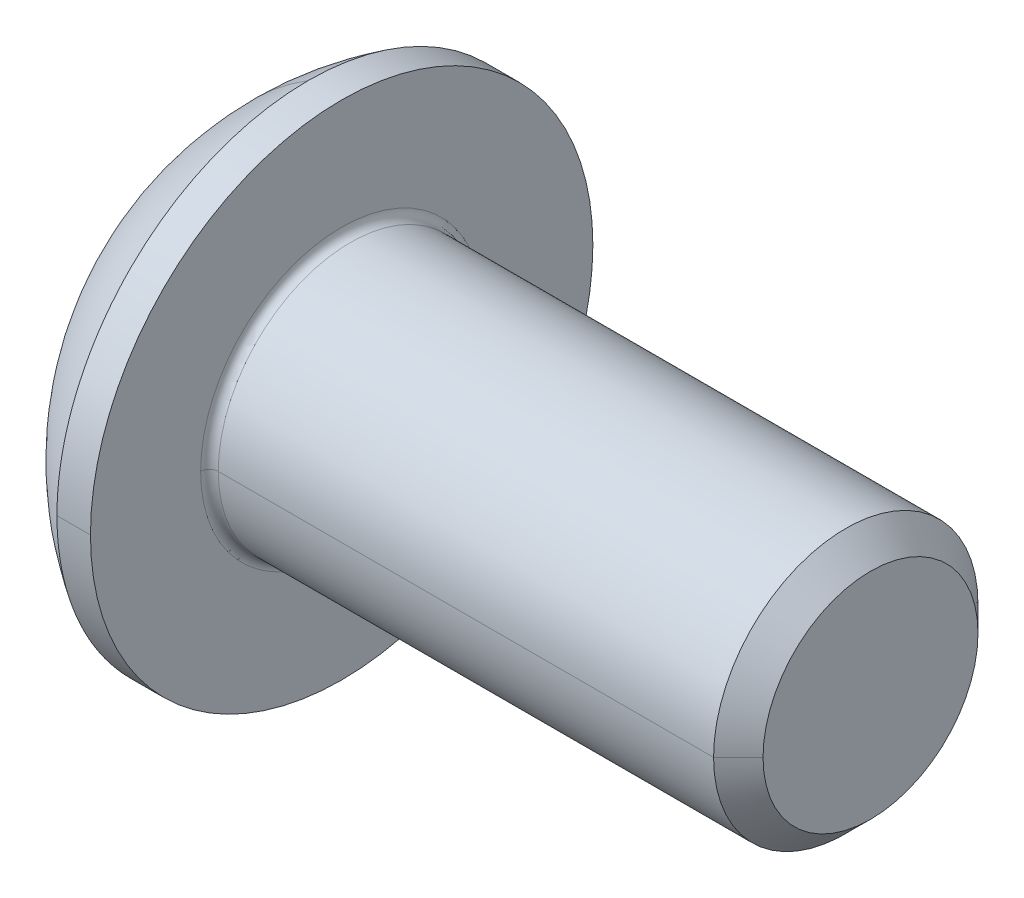
ISO-10303-21;
HEADER;
FILE_DESCRIPTION(('STEP AP214'),'2;1');
FILE_NAME('part.step','',(''),(''),'','','');
FILE_SCHEMA(('AUTOMOTIVE_DESIGN { 1 0 10303 214 1 1 1 1 }'));
ENDSEC;
DATA;
#1=APPLICATION_CONTEXT('core data for automotive mechanical design processes');
#2=APPLICATION_PROTOCOL_DEFINITION('international standard','automotive_design',2000,#1);
#3=PRODUCT_CONTEXT('',#1,'mechanical');
#4=PRODUCT('Part','Part','',(#3));
#5=PRODUCT_RELATED_PRODUCT_CATEGORY('part','',(#4));
#6=PRODUCT_DEFINITION_FORMATION('','',#4);
#7=PRODUCT_DEFINITION_CONTEXT('part definition',#1,'design');
#8=PRODUCT_DEFINITION('design','',#6,#7);
#9=PRODUCT_DEFINITION_SHAPE('','',#8);
#10=(LENGTH_UNIT() NAMED_UNIT(*) SI_UNIT(.MILLI.,.METRE.));
#11=(NAMED_UNIT(*) PLANE_ANGLE_UNIT() SI_UNIT($,.RADIAN.));
#12=(NAMED_UNIT(*) SI_UNIT($,.STERADIAN.) SOLID_ANGLE_UNIT());
#13=UNCERTAINTY_MEASURE_WITH_UNIT(LENGTH_MEASURE(1.E-05),#10,'distance_accuracy_value','');
#14=(GEOMETRIC_REPRESENTATION_CONTEXT(3) GLOBAL_UNCERTAINTY_ASSIGNED_CONTEXT((#13)) GLOBAL_UNIT_ASSIGNED_CONTEXT((#10,
#11,#12)) REPRESENTATION_CONTEXT('',''));
#15=CARTESIAN_POINT('',(0.,0.,0.));
#16=DIRECTION('',(0.,0.,1.));
#17=DIRECTION('',(1.,0.,0.));
#18=AXIS2_PLACEMENT_3D('',#15,#16,#17);
#19=CARTESIAN_POINT('',(-998.38264973081,0.,0.));
#20=DIRECTION('',(-1.,0.,0.));
#21=DIRECTION('',(0.,0.,1.));
#22=AXIS2_PLACEMENT_3D('',#19,#20,#21);
#23=CONICAL_SURFACE('',#22,1732.05080756885,1.0471975511966);
#24=DIRECTION('',(-0.5,0.,-0.866025403784436));
#25=VECTOR('',#24,1.);
#26=CARTESIAN_POINT('',(1.61735026918964,0.,0.));
#27=LINE('',#26,#25);
#28=CARTESIAN_POINT('',(1.61735026918964,0.,0.));
#29=VERTEX_POINT('',#28);
#30=CARTESIAN_POINT('',(1.04,0.,-1.));
#31=VERTEX_POINT('',#30);
#32=EDGE_CURVE('E214',#29,#31,#27,.T.);
#33=ORIENTED_EDGE('',*,*,#32,.F.);
#34=DIRECTION('',(-0.5,0.,0.866025403784436));
#35=VECTOR('',#34,1.);
#36=CARTESIAN_POINT('',(1.61735026918964,0.,0.));
#37=LINE('',#36,#35);
#38=CARTESIAN_POINT('',(1.04,0.,1.));
#39=VERTEX_POINT('',#38);
#40=EDGE_CURVE('E207',#29,#39,#37,.T.);
#41=ORIENTED_EDGE('',*,*,#40,.T.);
#42=CARTESIAN_POINT('',(1.04,0.,0.));
#43=DIRECTION('',(-1.,0.,0.));
#44=DIRECTION('',(0.,0.,1.));
#45=AXIS2_PLACEMENT_3D('',#42,#43,#44);
#46=CIRCLE('',#45,1.);
#47=CARTESIAN_POINT('',(1.04,0.86602540378444,0.5));
#48=VERTEX_POINT('',#47);
#49=EDGE_CURVE('E11',#39,#48,#46,.T.);
#50=ORIENTED_EDGE('',*,*,#49,.T.);
#51=CARTESIAN_POINT('',(1.04,0.,0.));
#52=DIRECTION('',(-1.,0.,0.));
#53=DIRECTION('',(0.,0.,1.));
#54=AXIS2_PLACEMENT_3D('',#51,#52,#53);
#55=CIRCLE('',#54,1.);
#56=CARTESIAN_POINT('',(1.04,0.86602540378444,-0.5));
#57=VERTEX_POINT('',#56);
#58=EDGE_CURVE('E24',#48,#57,#55,.T.);
#59=ORIENTED_EDGE('',*,*,#58,.T.);
#60=CARTESIAN_POINT('',(1.04,0.,0.));
#61=DIRECTION('',(-1.,0.,0.));
#62=DIRECTION('',(0.,0.,1.));
#63=AXIS2_PLACEMENT_3D('',#60,#61,#62);
#64=CIRCLE('',#63,1.);
#65=EDGE_CURVE('E196',#57,#31,#64,.T.);
#66=ORIENTED_EDGE('',*,*,#65,.T.);
#67=EDGE_LOOP('',(#33,#41,#50,#59,#66));
#68=FACE_BOUND('',#67,.T.);
#69=ADVANCED_FACE('F16',(#68),#23,.F.);
#70=CARTESIAN_POINT('',(1.04,-1.73205080756887,-1.));
#71=DIRECTION('',(1.,0.,0.));
#72=DIRECTION('',(0.,1.,0.));
#73=AXIS2_PLACEMENT_3D('',#70,#71,#72);
#74=PLANE('',#73);
#75=CARTESIAN_POINT('',(1.04,0.,0.));
#76=DIRECTION('',(-1.,0.,0.));
#77=DIRECTION('',(0.,0.,1.));
#78=AXIS2_PLACEMENT_3D('',#75,#76,#77);
#79=CIRCLE('',#78,1.);
#80=CARTESIAN_POINT('',(1.04,-0.86602540378444,-0.5));
#81=VERTEX_POINT('',#80);
#82=EDGE_CURVE('E221',#31,#81,#79,.T.);
#83=ORIENTED_EDGE('',*,*,#82,.F.);
#84=DIRECTION('',(0.,1.,0.));
#85=VECTOR('',#84,1.);
#86=CARTESIAN_POINT('',(1.04,0.577350269189628,-1.));
#87=LINE('',#86,#85);
#88=CARTESIAN_POINT('',(1.04,-0.577350269189626,-1.));
#89=VERTEX_POINT('',#88);
#90=EDGE_CURVE('E290',#89,#31,#87,.T.);
#91=ORIENTED_EDGE('',*,*,#90,.F.);
#92=DIRECTION('',(0.,0.5,-0.86602540378444));
#93=VECTOR('',#92,1.);
#94=CARTESIAN_POINT('',(1.04,-0.577350269189626,-1.));
#95=LINE('',#94,#93);
#96=EDGE_CURVE('E232',#81,#89,#95,.T.);
#97=ORIENTED_EDGE('',*,*,#96,.F.);
#98=EDGE_LOOP('',(#83,#91,#97));
#99=FACE_BOUND('',#98,.T.);
#100=ADVANCED_FACE('F420',(#99),#74,.F.);
#101=CARTESIAN_POINT('',(1.04,-1.73205080756887,-1.));
#102=DIRECTION('',(1.,0.,0.));
#103=DIRECTION('',(0.,1.,0.));
#104=AXIS2_PLACEMENT_3D('',#101,#102,#103);
#105=PLANE('',#104);
#106=CARTESIAN_POINT('',(1.04,0.,0.));
#107=DIRECTION('',(-1.,0.,0.));
#108=DIRECTION('',(0.,0.,1.));
#109=AXIS2_PLACEMENT_3D('',#106,#107,#108);
#110=CIRCLE('',#109,1.);
#111=CARTESIAN_POINT('',(1.04,-0.866025403784437,0.5));
#112=VERTEX_POINT('',#111);
#113=EDGE_CURVE('E210',#81,#112,#110,.T.);
#114=ORIENTED_EDGE('',*,*,#113,.F.);
#115=DIRECTION('',(0.,0.5,-0.86602540378444));
#116=VECTOR('',#115,1.);
#117=CARTESIAN_POINT('',(1.04,-0.577350269189626,-1.));
#118=LINE('',#117,#116);
#119=CARTESIAN_POINT('',(1.04,-1.15470053837925,0.));
#120=VERTEX_POINT('',#119);
#121=EDGE_CURVE('E236',#120,#81,#118,.T.);
#122=ORIENTED_EDGE('',*,*,#121,.F.);
#123=DIRECTION('',(0.,-0.5,-0.866025403784439));
#124=VECTOR('',#123,1.);
#125=CARTESIAN_POINT('',(1.04,-1.15470053837925,0.));
#126=LINE('',#125,#124);
#127=EDGE_CURVE('E359',#112,#120,#126,.T.);
#128=ORIENTED_EDGE('',*,*,#127,.F.);
#129=EDGE_LOOP('',(#114,#122,#128));
#130=FACE_BOUND('',#129,.T.);
#131=ADVANCED_FACE('F426',(#130),#105,.F.);
#132=CARTESIAN_POINT('',(1.04,-1.73205080756887,-1.));
#133=DIRECTION('',(1.,0.,0.));
#134=DIRECTION('',(0.,1.,0.));
#135=AXIS2_PLACEMENT_3D('',#132,#133,#134);
#136=PLANE('',#135);
#137=CARTESIAN_POINT('',(1.04,0.,0.));
#138=DIRECTION('',(-1.,0.,0.));
#139=DIRECTION('',(0.,0.,1.));
#140=AXIS2_PLACEMENT_3D('',#137,#138,#139);
#141=CIRCLE('',#140,1.);
#142=EDGE_CURVE('E189',#112,#39,#141,.T.);
#143=ORIENTED_EDGE('',*,*,#142,.F.);
#144=DIRECTION('',(0.,-0.5,-0.866025403784439));
#145=VECTOR('',#144,1.);
#146=CARTESIAN_POINT('',(1.04,-1.15470053837925,0.));
#147=LINE('',#146,#145);
#148=CARTESIAN_POINT('',(1.04,-0.577350269189625,1.));
#149=VERTEX_POINT('',#148);
#150=EDGE_CURVE('E192',#149,#112,#147,.T.);
#151=ORIENTED_EDGE('',*,*,#150,.F.);
#152=DIRECTION('',(0.,-1.,0.));
#153=VECTOR('',#152,1.);
#154=CARTESIAN_POINT('',(1.04,-0.577350269189625,1.));
#155=LINE('',#154,#153);
#156=EDGE_CURVE('E186',#39,#149,#155,.T.);
#157=ORIENTED_EDGE('',*,*,#156,.F.);
#158=EDGE_LOOP('',(#143,#151,#157));
#159=FACE_BOUND('',#158,.T.);
#160=ADVANCED_FACE('F187',(#159),#136,.F.);
#161=CARTESIAN_POINT('',(1.04,-1.73205080756887,-1.));
#162=DIRECTION('',(1.,0.,0.));
#163=DIRECTION('',(0.,1.,0.));
#164=AXIS2_PLACEMENT_3D('',#161,#162,#163);
#165=PLANE('',#164);
#166=ORIENTED_EDGE('',*,*,#49,.F.);
#167=DIRECTION('',(0.,-1.,0.));
#168=VECTOR('',#167,1.);
#169=CARTESIAN_POINT('',(1.04,-0.577350269189625,1.));
#170=LINE('',#169,#168);
#171=CARTESIAN_POINT('',(1.04,0.577350269189628,1.));
#172=VERTEX_POINT('',#171);
#173=EDGE_CURVE('E37',#172,#39,#170,.T.);
#174=ORIENTED_EDGE('',*,*,#173,.F.);
#175=DIRECTION('',(0.,-0.5,0.86602540378444));
#176=VECTOR('',#175,1.);
#177=CARTESIAN_POINT('',(1.04,0.577350269189628,1.));
#178=LINE('',#177,#176);
#179=EDGE_CURVE('E181',#48,#172,#178,.T.);
#180=ORIENTED_EDGE('',*,*,#179,.F.);
#181=EDGE_LOOP('',(#166,#174,#180));
#182=FACE_BOUND('',#181,.T.);
#183=ADVANCED_FACE('F179',(#182),#165,.F.);
#184=CARTESIAN_POINT('',(1.04,-1.73205080756887,-1.));
#185=DIRECTION('',(1.,0.,0.));
#186=DIRECTION('',(0.,1.,0.));
#187=AXIS2_PLACEMENT_3D('',#184,#185,#186);
#188=PLANE('',#187);
#189=ORIENTED_EDGE('',*,*,#58,.F.);
#190=DIRECTION('',(0.,-0.5,0.86602540378444));
#191=VECTOR('',#190,1.);
#192=CARTESIAN_POINT('',(1.04,0.577350269189628,1.));
#193=LINE('',#192,#191);
#194=CARTESIAN_POINT('',(1.04,1.15470053837925,0.));
#195=VERTEX_POINT('',#194);
#196=EDGE_CURVE('E372',#195,#48,#193,.T.);
#197=ORIENTED_EDGE('',*,*,#196,.F.);
#198=DIRECTION('',(0.,0.5,0.86602540378444));
#199=VECTOR('',#198,1.);
#200=CARTESIAN_POINT('',(1.04,1.15470053837925,0.));
#201=LINE('',#200,#199);
#202=EDGE_CURVE('E384',#57,#195,#201,.T.);
#203=ORIENTED_EDGE('',*,*,#202,.F.);
#204=EDGE_LOOP('',(#189,#197,#203));
#205=FACE_BOUND('',#204,.T.);
#206=ADVANCED_FACE('F409',(#205),#188,.F.);
#207=CARTESIAN_POINT('',(1.04,-1.73205080756887,-1.));
#208=DIRECTION('',(1.,0.,0.));
#209=DIRECTION('',(0.,1.,0.));
#210=AXIS2_PLACEMENT_3D('',#207,#208,#209);
#211=PLANE('',#210);
#212=ORIENTED_EDGE('',*,*,#65,.F.);
#213=DIRECTION('',(0.,0.5,0.86602540378444));
#214=VECTOR('',#213,1.);
#215=CARTESIAN_POINT('',(1.04,1.15470053837925,0.));
#216=LINE('',#215,#214);
#217=CARTESIAN_POINT('',(1.04,0.577350269189628,-1.));
#218=VERTEX_POINT('',#217);
#219=EDGE_CURVE('E380',#218,#57,#216,.T.);
#220=ORIENTED_EDGE('',*,*,#219,.F.);
#221=DIRECTION('',(0.,1.,0.));
#222=VECTOR('',#221,1.);
#223=CARTESIAN_POINT('',(1.04,0.577350269189628,-1.));
#224=LINE('',#223,#222);
#225=EDGE_CURVE('E379',#31,#218,#224,.T.);
#226=ORIENTED_EDGE('',*,*,#225,.F.);
#227=EDGE_LOOP('',(#212,#220,#226));
#228=FACE_BOUND('',#227,.T.);
#229=ADVANCED_FACE('F407',(#228),#211,.F.);
#230=CARTESIAN_POINT('',(1.04,-0.577350269189625,1.));
#231=DIRECTION('',(0.,0.,-1.));
#232=DIRECTION('',(-1.,0.,0.));
#233=AXIS2_PLACEMENT_3D('',#230,#231,#232);
#234=PLANE('',#233);
#235=ORIENTED_EDGE('',*,*,#173,.T.);
#236=ORIENTED_EDGE('',*,*,#156,.T.);
#237=DIRECTION('',(-1.,0.,0.));
#238=VECTOR('',#237,1.);
#239=CARTESIAN_POINT('',(1.04,-0.577350269189625,1.));
#240=LINE('',#239,#238);
#241=CARTESIAN_POINT('',(0.,-0.577350269189625,1.));
#242=VERTEX_POINT('',#241);
#243=EDGE_CURVE('E366',#149,#242,#240,.T.);
#244=ORIENTED_EDGE('',*,*,#243,.T.);
#245=DIRECTION('',(0.,-1.,0.));
#246=VECTOR('',#245,1.);
#247=CARTESIAN_POINT('',(0.,-0.577350269189625,1.));
#248=LINE('',#247,#246);
#249=CARTESIAN_POINT('',(0.,0.577350269189628,1.));
#250=VERTEX_POINT('',#249);
#251=EDGE_CURVE('E301',#250,#242,#248,.T.);
#252=ORIENTED_EDGE('',*,*,#251,.F.);
#253=DIRECTION('',(-1.,0.,0.));
#254=VECTOR('',#253,1.);
#255=CARTESIAN_POINT('',(1.04,0.577350269189628,1.));
#256=LINE('',#255,#254);
#257=EDGE_CURVE('E200',#172,#250,#256,.T.);
#258=ORIENTED_EDGE('',*,*,#257,.F.);
#259=EDGE_LOOP('',(#235,#236,#244,#252,#258));
#260=FACE_BOUND('',#259,.T.);
#261=ADVANCED_FACE('F198',(#260),#234,.T.);
#262=CARTESIAN_POINT('',(1.04,0.577350269189628,1.));
#263=DIRECTION('',(0.,-0.86602540378444,-0.5));
#264=DIRECTION('',(0.,0.5,-0.86602540378444));
#265=AXIS2_PLACEMENT_3D('',#262,#263,#264);
#266=PLANE('',#265);
#267=ORIENTED_EDGE('',*,*,#196,.T.);
#268=ORIENTED_EDGE('',*,*,#179,.T.);
#269=ORIENTED_EDGE('',*,*,#257,.T.);
#270=DIRECTION('',(0.,-0.5,0.86602540378444));
#271=VECTOR('',#270,1.);
#272=CARTESIAN_POINT('',(0.,0.577350269189628,1.));
#273=LINE('',#272,#271);
#274=CARTESIAN_POINT('',(0.,1.15470053837925,0.));
#275=VERTEX_POINT('',#274);
#276=EDGE_CURVE('E293',#275,#250,#273,.T.);
#277=ORIENTED_EDGE('',*,*,#276,.F.);
#278=DIRECTION('',(-1.,0.,0.));
#279=VECTOR('',#278,1.);
#280=CARTESIAN_POINT('',(1.04,1.15470053837925,0.));
#281=LINE('',#280,#279);
#282=EDGE_CURVE('E375',#195,#275,#281,.T.);
#283=ORIENTED_EDGE('',*,*,#282,.F.);
#284=EDGE_LOOP('',(#267,#268,#269,#277,#283));
#285=FACE_BOUND('',#284,.T.);
#286=ADVANCED_FACE('F435',(#285),#266,.T.);
#287=CARTESIAN_POINT('',(1.04,1.15470053837925,0.));
#288=DIRECTION('',(0.,-0.86602540378444,0.5));
#289=DIRECTION('',(-1.,0.,0.));
#290=AXIS2_PLACEMENT_3D('',#287,#288,#289);
#291=PLANE('',#290);
#292=ORIENTED_EDGE('',*,*,#219,.T.);
#293=ORIENTED_EDGE('',*,*,#202,.T.);
#294=ORIENTED_EDGE('',*,*,#282,.T.);
#295=DIRECTION('',(0.,0.5,0.86602540378444));
#296=VECTOR('',#295,1.);
#297=CARTESIAN_POINT('',(0.,1.15470053837925,0.));
#298=LINE('',#297,#296);
#299=CARTESIAN_POINT('',(0.,0.577350269189628,-1.));
#300=VERTEX_POINT('',#299);
#301=EDGE_CURVE('E348',#300,#275,#298,.T.);
#302=ORIENTED_EDGE('',*,*,#301,.F.);
#303=DIRECTION('',(-1.,0.,0.));
#304=VECTOR('',#303,1.);
#305=CARTESIAN_POINT('',(1.04,0.577350269189628,-1.));
#306=LINE('',#305,#304);
#307=EDGE_CURVE('E385',#218,#300,#306,.T.);
#308=ORIENTED_EDGE('',*,*,#307,.F.);
#309=EDGE_LOOP('',(#292,#293,#294,#302,#308));
#310=FACE_BOUND('',#309,.T.);
#311=ADVANCED_FACE('F412',(#310),#291,.T.);
#312=CARTESIAN_POINT('',(1.04,0.577350269189628,-1.));
#313=DIRECTION('',(0.,0.,1.));
#314=DIRECTION('',(1.,0.,0.));
#315=AXIS2_PLACEMENT_3D('',#312,#313,#314);
#316=PLANE('',#315);
#317=ORIENTED_EDGE('',*,*,#90,.T.);
#318=ORIENTED_EDGE('',*,*,#225,.T.);
#319=ORIENTED_EDGE('',*,*,#307,.T.);
#320=DIRECTION('',(0.,1.,0.));
#321=VECTOR('',#320,1.);
#322=CARTESIAN_POINT('',(0.,0.577350269189628,-1.));
#323=LINE('',#322,#321);
#324=CARTESIAN_POINT('',(0.,-0.577350269189626,-1.));
#325=VERTEX_POINT('',#324);
#326=EDGE_CURVE('E344',#325,#300,#323,.T.);
#327=ORIENTED_EDGE('',*,*,#326,.F.);
#328=DIRECTION('',(-1.,0.,0.));
#329=VECTOR('',#328,1.);
#330=CARTESIAN_POINT('',(1.04,-0.577350269189626,-1.));
#331=LINE('',#330,#329);
#332=EDGE_CURVE('E235',#89,#325,#331,.T.);
#333=ORIENTED_EDGE('',*,*,#332,.F.);
#334=EDGE_LOOP('',(#317,#318,#319,#327,#333));
#335=FACE_BOUND('',#334,.T.);
#336=ADVANCED_FACE('F416',(#335),#316,.T.);
#337=CARTESIAN_POINT('',(1.04,-0.577350269189626,-1.));
#338=DIRECTION('',(0.,0.86602540378444,0.5));
#339=DIRECTION('',(1.,0.,0.));
#340=AXIS2_PLACEMENT_3D('',#337,#338,#339);
#341=PLANE('',#340);
#342=ORIENTED_EDGE('',*,*,#121,.T.);
#343=ORIENTED_EDGE('',*,*,#96,.T.);
#344=ORIENTED_EDGE('',*,*,#332,.T.);
#345=DIRECTION('',(0.,0.5,-0.86602540378444));
#346=VECTOR('',#345,1.);
#347=CARTESIAN_POINT('',(0.,-0.577350269189626,-1.));
#348=LINE('',#347,#346);
#349=CARTESIAN_POINT('',(0.,-1.15470053837925,0.));
#350=VERTEX_POINT('',#349);
#351=EDGE_CURVE('E340',#350,#325,#348,.T.);
#352=ORIENTED_EDGE('',*,*,#351,.F.);
#353=DIRECTION('',(-1.,0.,0.));
#354=VECTOR('',#353,1.);
#355=CARTESIAN_POINT('',(1.04,-1.15470053837925,0.));
#356=LINE('',#355,#354);
#357=EDGE_CURVE('E363',#120,#350,#356,.T.);
#358=ORIENTED_EDGE('',*,*,#357,.F.);
#359=EDGE_LOOP('',(#342,#343,#344,#352,#358));
#360=FACE_BOUND('',#359,.T.);
#361=ADVANCED_FACE('F423',(#360),#341,.T.);
#362=CARTESIAN_POINT('',(1.04,-1.15470053837925,0.));
#363=DIRECTION('',(0.,0.866025403784439,-0.5));
#364=DIRECTION('',(-1.,0.,0.));
#365=AXIS2_PLACEMENT_3D('',#362,#363,#364);
#366=PLANE('',#365);
#367=ORIENTED_EDGE('',*,*,#150,.T.);
#368=ORIENTED_EDGE('',*,*,#127,.T.);
#369=ORIENTED_EDGE('',*,*,#357,.T.);
#370=DIRECTION('',(0.,-0.5,-0.866025403784439));
#371=VECTOR('',#370,1.);
#372=CARTESIAN_POINT('',(0.,-1.15470053837925,0.));
#373=LINE('',#372,#371);
#374=EDGE_CURVE('E336',#242,#350,#373,.T.);
#375=ORIENTED_EDGE('',*,*,#374,.F.);
#376=ORIENTED_EDGE('',*,*,#243,.F.);
#377=EDGE_LOOP('',(#367,#368,#369,#375,#376));
#378=FACE_BOUND('',#377,.T.);
#379=ADVANCED_FACE('F428',(#378),#366,.T.);
#380=CARTESIAN_POINT('',(1.75,0.,0.));
#381=DIRECTION('',(-1.,0.,0.));
#382=DIRECTION('',(0.,0.,1.));
#383=AXIS2_PLACEMENT_3D('',#380,#381,#382);
#384=TOROIDAL_SURFACE('',#383,1.6,0.1);
#385=CARTESIAN_POINT('',(1.75,0.,-1.6));
#386=DIRECTION('',(0.,1.,0.));
#387=DIRECTION('',(0.,0.,1.));
#388=AXIS2_PLACEMENT_3D('',#385,#386,#387);
#389=CIRCLE('',#388,0.1);
#390=CARTESIAN_POINT('',(1.65,0.,-1.6));
#391=VERTEX_POINT('',#390);
#392=CARTESIAN_POINT('',(1.75,0.,-1.5));
#393=VERTEX_POINT('',#392);
#394=EDGE_CURVE('E231',#391,#393,#389,.T.);
#395=ORIENTED_EDGE('',*,*,#394,.F.);
#396=CARTESIAN_POINT('',(1.65,0.,0.));
#397=DIRECTION('',(-1.,0.,0.));
#398=DIRECTION('',(0.,0.,1.));
#399=AXIS2_PLACEMENT_3D('',#396,#397,#398);
#400=CIRCLE('',#399,1.6);
#401=CARTESIAN_POINT('',(1.65,0.,1.6));
#402=VERTEX_POINT('',#401);
#403=EDGE_CURVE('E244',#402,#391,#400,.T.);
#404=ORIENTED_EDGE('',*,*,#403,.F.);
#405=CARTESIAN_POINT('',(1.75,0.,1.6));
#406=DIRECTION('',(0.,-1.,0.));
#407=DIRECTION('',(0.,0.,-1.));
#408=AXIS2_PLACEMENT_3D('',#405,#406,#407);
#409=CIRCLE('',#408,0.1);
#410=CARTESIAN_POINT('',(1.75,0.,1.5));
#411=VERTEX_POINT('',#410);
#412=EDGE_CURVE('E230',#402,#411,#409,.T.);
#413=ORIENTED_EDGE('',*,*,#412,.T.);
#414=CARTESIAN_POINT('',(1.75,0.,0.));
#415=DIRECTION('',(1.,0.,0.));
#416=DIRECTION('',(0.,0.,1.));
#417=AXIS2_PLACEMENT_3D('',#414,#415,#416);
#418=CIRCLE('',#417,1.5);
#419=EDGE_CURVE('E259',#393,#411,#418,.T.);
#420=ORIENTED_EDGE('',*,*,#419,.F.);
#421=EDGE_LOOP('',(#395,#404,#413,#420));
#422=FACE_BOUND('',#421,.T.);
#423=ADVANCED_FACE('F518',(#422),#384,.F.);
#424=CARTESIAN_POINT('',(7.65,0.,0.));
#425=DIRECTION('',(-1.,0.,0.));
#426=DIRECTION('',(0.,0.,1.));
#427=AXIS2_PLACEMENT_3D('',#424,#425,#426);
#428=PLANE('',#427);
#429=CARTESIAN_POINT('',(7.65,0.,0.));
#430=DIRECTION('',(-1.,0.,0.));
#431=DIRECTION('',(0.,0.,1.));
#432=AXIS2_PLACEMENT_3D('',#429,#430,#431);
#433=CIRCLE('',#432,1.2195);
#434=CARTESIAN_POINT('',(7.65,0.,1.2195));
#435=VERTEX_POINT('',#434);
#436=CARTESIAN_POINT('',(7.65,0.,-1.2195));
#437=VERTEX_POINT('',#436);
#438=EDGE_CURVE('E242',#435,#437,#433,.T.);
#439=ORIENTED_EDGE('',*,*,#438,.F.);
#440=CARTESIAN_POINT('',(7.65,0.,0.));
#441=DIRECTION('',(-1.,0.,0.));
#442=DIRECTION('',(0.,0.,1.));
#443=AXIS2_PLACEMENT_3D('',#440,#441,#442);
#444=CIRCLE('',#443,1.2195);
#445=EDGE_CURVE('E284',#437,#435,#444,.T.);
#446=ORIENTED_EDGE('',*,*,#445,.F.);
#447=EDGE_LOOP('',(#439,#446));
#448=FACE_BOUND('',#447,.T.);
#449=ADVANCED_FACE('F528',(#448),#428,.F.);
#450=CARTESIAN_POINT('',(7.65,0.,0.));
#451=DIRECTION('',(-1.,0.,0.));
#452=DIRECTION('',(0.,0.,1.));
#453=AXIS2_PLACEMENT_3D('',#450,#451,#452);
#454=CONICAL_SURFACE('',#453,1.2195,0.785398163397439);
#455=DIRECTION('',(-0.707106781186554,0.,-0.707106781186541));
#456=VECTOR('',#455,1.);
#457=CARTESIAN_POINT('',(7.65,0.,-1.2195));
#458=LINE('',#457,#456);
#459=CARTESIAN_POINT('',(7.3695,0.,-1.5));
#460=VERTEX_POINT('',#459);
#461=EDGE_CURVE('E238',#437,#460,#458,.T.);
#462=ORIENTED_EDGE('',*,*,#461,.F.);
#463=ORIENTED_EDGE('',*,*,#445,.T.);
#464=DIRECTION('',(-0.707106781186554,0.,0.707106781186541));
#465=VECTOR('',#464,1.);
#466=CARTESIAN_POINT('',(7.65,0.,1.2195));
#467=LINE('',#466,#465);
#468=CARTESIAN_POINT('',(7.3695,0.,1.5));
#469=VERTEX_POINT('',#468);
#470=EDGE_CURVE('E225',#435,#469,#467,.T.);
#471=ORIENTED_EDGE('',*,*,#470,.T.);
#472=CARTESIAN_POINT('',(7.3695,0.,0.));
#473=DIRECTION('',(-1.,0.,0.));
#474=DIRECTION('',(0.,0.,1.));
#475=AXIS2_PLACEMENT_3D('',#472,#473,#474);
#476=CIRCLE('',#475,1.5);
#477=EDGE_CURVE('E247',#460,#469,#476,.T.);
#478=ORIENTED_EDGE('',*,*,#477,.F.);
#479=EDGE_LOOP('',(#462,#463,#471,#478));
#480=FACE_BOUND('',#479,.T.);
#481=ADVANCED_FACE('F540',(#480),#454,.T.);
#482=CARTESIAN_POINT('',(0.,0.,0.));
#483=DIRECTION('',(-1.,0.,0.));
#484=DIRECTION('',(0.,0.,1.));
#485=AXIS2_PLACEMENT_3D('',#482,#483,#484);
#486=CYLINDRICAL_SURFACE('',#485,1.5);
#487=DIRECTION('',(-1.,0.,0.));
#488=VECTOR('',#487,1.);
#489=CARTESIAN_POINT('',(0.,0.,-1.5));
#490=LINE('',#489,#488);
#491=EDGE_CURVE('E255',#460,#393,#490,.T.);
#492=ORIENTED_EDGE('',*,*,#491,.F.);
#493=ORIENTED_EDGE('',*,*,#477,.T.);
#494=DIRECTION('',(-1.,0.,0.));
#495=VECTOR('',#494,1.);
#496=CARTESIAN_POINT('',(0.,0.,1.5));
#497=LINE('',#496,#495);
#498=EDGE_CURVE('E272',#469,#411,#497,.T.);
#499=ORIENTED_EDGE('',*,*,#498,.T.);
#500=CARTESIAN_POINT('',(1.75,0.,0.));
#501=DIRECTION('',(1.,0.,0.));
#502=DIRECTION('',(0.,0.,1.));
#503=AXIS2_PLACEMENT_3D('',#500,#501,#502);
#504=CIRCLE('',#503,1.5);
#505=EDGE_CURVE('E226',#411,#393,#504,.T.);
#506=ORIENTED_EDGE('',*,*,#505,.T.);
#507=EDGE_LOOP('',(#492,#493,#499,#506));
#508=FACE_BOUND('',#507,.T.);
#509=ADVANCED_FACE('F550',(#508),#486,.T.);
#510=CARTESIAN_POINT('',(1.65,1.5,0.));
#511=DIRECTION('',(-1.,0.,0.));
#512=DIRECTION('',(0.,0.,1.));
#513=AXIS2_PLACEMENT_3D('',#510,#511,#512);
#514=PLANE('',#513);
#515=ORIENTED_EDGE('',*,*,#403,.T.);
#516=CARTESIAN_POINT('',(1.65,0.,0.));
#517=DIRECTION('',(-1.,0.,0.));
#518=DIRECTION('',(0.,0.,1.));
#519=AXIS2_PLACEMENT_3D('',#516,#517,#518);
#520=CIRCLE('',#519,1.6);
#521=EDGE_CURVE('E212',#391,#402,#520,.T.);
#522=ORIENTED_EDGE('',*,*,#521,.T.);
#523=EDGE_LOOP('',(#515,#522));
#524=FACE_BOUND('',#523,.T.);
#525=CARTESIAN_POINT('',(1.65,0.,0.));
#526=DIRECTION('',(-1.,0.,0.));
#527=DIRECTION('',(0.,0.,1.));
#528=AXIS2_PLACEMENT_3D('',#525,#526,#527);
#529=CIRCLE('',#528,2.85);
#530=CARTESIAN_POINT('',(1.65,0.,2.85));
#531=VERTEX_POINT('',#530);
#532=CARTESIAN_POINT('',(1.65,0.,-2.85));
#533=VERTEX_POINT('',#532);
#534=EDGE_CURVE('E287',#531,#533,#529,.T.);
#535=ORIENTED_EDGE('',*,*,#534,.F.);
#536=CARTESIAN_POINT('',(1.65,0.,0.));
#537=DIRECTION('',(-1.,0.,0.));
#538=DIRECTION('',(0.,0.,1.));
#539=AXIS2_PLACEMENT_3D('',#536,#537,#538);
#540=CIRCLE('',#539,2.85);
#541=EDGE_CURVE('E248',#533,#531,#540,.T.);
#542=ORIENTED_EDGE('',*,*,#541,.F.);
#543=EDGE_LOOP('',(#535,#542));
#544=FACE_BOUND('',#543,.T.);
#545=ADVANCED_FACE('F562',(#524,#544),#514,.F.);
#546=CARTESIAN_POINT('',(0.,0.,0.));
#547=DIRECTION('',(-1.,0.,0.));
#548=DIRECTION('',(0.,0.,1.));
#549=AXIS2_PLACEMENT_3D('',#546,#547,#548);
#550=CYLINDRICAL_SURFACE('',#549,2.85);
#551=DIRECTION('',(-1.,0.,0.));
#552=VECTOR('',#551,1.);
#553=CARTESIAN_POINT('',(0.,0.,-2.85));
#554=LINE('',#553,#552);
#555=CARTESIAN_POINT('',(1.27,0.,-2.85));
#556=VERTEX_POINT('',#555);
#557=EDGE_CURVE('E297',#533,#556,#554,.T.);
#558=ORIENTED_EDGE('',*,*,#557,.F.);
#559=ORIENTED_EDGE('',*,*,#541,.T.);
#560=DIRECTION('',(-1.,0.,0.));
#561=VECTOR('',#560,1.);
#562=CARTESIAN_POINT('',(0.,0.,2.85));
#563=LINE('',#562,#561);
#564=CARTESIAN_POINT('',(1.27,0.,2.85));
#565=VERTEX_POINT('',#564);
#566=EDGE_CURVE('E314',#531,#565,#563,.T.);
#567=ORIENTED_EDGE('',*,*,#566,.T.);
#568=CARTESIAN_POINT('',(1.27,0.,0.));
#569=DIRECTION('',(-1.,0.,0.));
#570=DIRECTION('',(0.,0.,1.));
#571=AXIS2_PLACEMENT_3D('',#568,#569,#570);
#572=CIRCLE('',#571,2.85);
#573=CARTESIAN_POINT('',(1.27,-2.85,0.));
#574=VERTEX_POINT('',#573);
#575=EDGE_CURVE('E278',#574,#565,#572,.T.);
#576=ORIENTED_EDGE('',*,*,#575,.F.);
#577=CARTESIAN_POINT('',(1.27,0.,0.));
#578=DIRECTION('',(-1.,0.,0.));
#579=DIRECTION('',(0.,0.,1.));
#580=AXIS2_PLACEMENT_3D('',#577,#578,#579);
#581=CIRCLE('',#580,2.85);
#582=EDGE_CURVE('E318',#556,#574,#581,.T.);
#583=ORIENTED_EDGE('',*,*,#582,.F.);
#584=EDGE_LOOP('',(#558,#559,#567,#576,#583));
#585=FACE_BOUND('',#584,.T.);
#586=ADVANCED_FACE('F574',(#585),#550,.T.);
#587=CARTESIAN_POINT('',(3.03337598425197,0.,0.));
#588=DIRECTION('',(0.,0.,-1.));
#589=DIRECTION('',(0.,1.,0.));
#590=AXIS2_PLACEMENT_3D('',#587,#588,#589);
#591=SPHERICAL_SURFACE('',#590,3.35141684393879);
#592=CARTESIAN_POINT('',(3.03337598425197,0.,0.));
#593=DIRECTION('',(0.,0.,-1.));
#594=DIRECTION('',(0.,1.,0.));
#595=AXIS2_PLACEMENT_3D('',#592,#593,#594);
#596=CIRCLE('',#595,3.35141684393879);
#597=CARTESIAN_POINT('',(0.,-1.425,0.));
#598=VERTEX_POINT('',#597);
#599=EDGE_CURVE('E322',#574,#598,#596,.T.);
#600=ORIENTED_EDGE('',*,*,#599,.F.);
#601=ORIENTED_EDGE('',*,*,#575,.T.);
#602=CARTESIAN_POINT('',(1.27,0.,0.));
#603=DIRECTION('',(-1.,0.,0.));
#604=DIRECTION('',(0.,0.,1.));
#605=AXIS2_PLACEMENT_3D('',#602,#603,#604);
#606=CIRCLE('',#605,2.85);
#607=CARTESIAN_POINT('',(1.27,2.85,0.));
#608=VERTEX_POINT('',#607);
#609=EDGE_CURVE('E310',#565,#608,#606,.T.);
#610=ORIENTED_EDGE('',*,*,#609,.T.);
#611=CARTESIAN_POINT('',(3.03337598425197,0.,0.));
#612=DIRECTION('',(0.,0.,1.));
#613=DIRECTION('',(1.,0.,0.));
#614=AXIS2_PLACEMENT_3D('',#611,#612,#613);
#615=CIRCLE('',#614,3.35141684393879);
#616=CARTESIAN_POINT('',(0.,1.425,0.));
#617=VERTEX_POINT('',#616);
#618=EDGE_CURVE('E302',#608,#617,#615,.T.);
#619=ORIENTED_EDGE('',*,*,#618,.T.);
#620=CARTESIAN_POINT('',(0.,0.,0.));
#621=DIRECTION('',(-1.,0.,0.));
#622=DIRECTION('',(0.,0.,1.));
#623=AXIS2_PLACEMENT_3D('',#620,#621,#622);
#624=CIRCLE('',#623,1.425);
#625=EDGE_CURVE('E298',#598,#617,#624,.T.);
#626=ORIENTED_EDGE('',*,*,#625,.F.);
#627=EDGE_LOOP('',(#600,#601,#610,#619,#626));
#628=FACE_BOUND('',#627,.T.);
#629=ADVANCED_FACE('F584',(#628),#591,.T.);
#630=CARTESIAN_POINT('',(0.,0.,0.));
#631=DIRECTION('',(-1.,0.,0.));
#632=DIRECTION('',(0.,0.,1.));
#633=AXIS2_PLACEMENT_3D('',#630,#631,#632);
#634=PLANE('',#633);
#635=ORIENTED_EDGE('',*,*,#251,.T.);
#636=ORIENTED_EDGE('',*,*,#374,.T.);
#637=ORIENTED_EDGE('',*,*,#351,.T.);
#638=ORIENTED_EDGE('',*,*,#326,.T.);
#639=ORIENTED_EDGE('',*,*,#301,.T.);
#640=ORIENTED_EDGE('',*,*,#276,.T.);
#641=EDGE_LOOP('',(#635,#636,#637,#638,#639,#640));
#642=FACE_BOUND('',#641,.T.);
#643=CARTESIAN_POINT('',(0.,0.,0.));
#644=DIRECTION('',(-1.,0.,0.));
#645=DIRECTION('',(0.,0.,1.));
#646=AXIS2_PLACEMENT_3D('',#643,#644,#645);
#647=CIRCLE('',#646,1.425);
#648=EDGE_CURVE('E326',#617,#598,#647,.T.);
#649=ORIENTED_EDGE('',*,*,#648,.T.);
#650=ORIENTED_EDGE('',*,*,#625,.T.);
#651=EDGE_LOOP('',(#649,#650));
#652=FACE_BOUND('',#651,.T.);
#653=ADVANCED_FACE('F431',(#642,#652),#634,.T.);
#654=CARTESIAN_POINT('',(3.03337598425197,0.,0.));
#655=DIRECTION('',(0.,0.,-1.));
#656=DIRECTION('',(0.,1.,0.));
#657=AXIS2_PLACEMENT_3D('',#654,#655,#656);
#658=SPHERICAL_SURFACE('',#657,3.35141684393879);
#659=CARTESIAN_POINT('',(1.27,0.,0.));
#660=DIRECTION('',(-1.,0.,0.));
#661=DIRECTION('',(0.,0.,1.));
#662=AXIS2_PLACEMENT_3D('',#659,#660,#661);
#663=CIRCLE('',#662,2.85);
#664=EDGE_CURVE('E306',#608,#556,#663,.T.);
#665=ORIENTED_EDGE('',*,*,#664,.T.);
#666=ORIENTED_EDGE('',*,*,#582,.T.);
#667=ORIENTED_EDGE('',*,*,#599,.T.);
#668=ORIENTED_EDGE('',*,*,#648,.F.);
#669=ORIENTED_EDGE('',*,*,#618,.F.);
#670=EDGE_LOOP('',(#665,#666,#667,#668,#669));
#671=FACE_BOUND('',#670,.T.);
#672=ADVANCED_FACE('F606',(#671),#658,.T.);
#673=CARTESIAN_POINT('',(0.,0.,0.));
#674=DIRECTION('',(-1.,0.,0.));
#675=DIRECTION('',(0.,0.,1.));
#676=AXIS2_PLACEMENT_3D('',#673,#674,#675);
#677=CYLINDRICAL_SURFACE('',#676,2.85);
#678=ORIENTED_EDGE('',*,*,#534,.T.);
#679=ORIENTED_EDGE('',*,*,#557,.T.);
#680=ORIENTED_EDGE('',*,*,#664,.F.);
#681=ORIENTED_EDGE('',*,*,#609,.F.);
#682=ORIENTED_EDGE('',*,*,#566,.F.);
#683=EDGE_LOOP('',(#678,#679,#680,#681,#682));
#684=FACE_BOUND('',#683,.T.);
#685=ADVANCED_FACE('F616',(#684),#677,.T.);
#686=CARTESIAN_POINT('',(0.,0.,0.));
#687=DIRECTION('',(-1.,0.,0.));
#688=DIRECTION('',(0.,0.,1.));
#689=AXIS2_PLACEMENT_3D('',#686,#687,#688);
#690=CYLINDRICAL_SURFACE('',#689,1.5);
#691=CARTESIAN_POINT('',(7.3695,0.,0.));
#692=DIRECTION('',(-1.,0.,0.));
#693=DIRECTION('',(0.,0.,1.));
#694=AXIS2_PLACEMENT_3D('',#691,#692,#693);
#695=CIRCLE('',#694,1.5);
#696=EDGE_CURVE('E241',#469,#460,#695,.T.);
#697=ORIENTED_EDGE('',*,*,#696,.T.);
#698=ORIENTED_EDGE('',*,*,#491,.T.);
#699=ORIENTED_EDGE('',*,*,#419,.T.);
#700=ORIENTED_EDGE('',*,*,#498,.F.);
#701=EDGE_LOOP('',(#697,#698,#699,#700));
#702=FACE_BOUND('',#701,.T.);
#703=ADVANCED_FACE('F628',(#702),#690,.T.);
#704=CARTESIAN_POINT('',(7.65,0.,0.));
#705=DIRECTION('',(-1.,0.,0.));
#706=DIRECTION('',(0.,0.,1.));
#707=AXIS2_PLACEMENT_3D('',#704,#705,#706);
#708=CONICAL_SURFACE('',#707,1.2195,0.785398163397439);
#709=ORIENTED_EDGE('',*,*,#438,.T.);
#710=ORIENTED_EDGE('',*,*,#461,.T.);
#711=ORIENTED_EDGE('',*,*,#696,.F.);
#712=ORIENTED_EDGE('',*,*,#470,.F.);
#713=EDGE_LOOP('',(#709,#710,#711,#712));
#714=FACE_BOUND('',#713,.T.);
#715=ADVANCED_FACE('F638',(#714),#708,.T.);
#716=CARTESIAN_POINT('',(1.75,0.,0.));
#717=DIRECTION('',(-1.,0.,0.));
#718=DIRECTION('',(0.,0.,1.));
#719=AXIS2_PLACEMENT_3D('',#716,#717,#718);
#720=TOROIDAL_SURFACE('',#719,1.6,0.1);
#721=ORIENTED_EDGE('',*,*,#521,.F.);
#722=ORIENTED_EDGE('',*,*,#394,.T.);
#723=ORIENTED_EDGE('',*,*,#505,.F.);
#724=ORIENTED_EDGE('',*,*,#412,.F.);
#725=EDGE_LOOP('',(#721,#722,#723,#724));
#726=FACE_BOUND('',#725,.T.);
#727=ADVANCED_FACE('F648',(#726),#720,.F.);
#728=CARTESIAN_POINT('',(-998.38264973081,0.,0.));
#729=DIRECTION('',(-1.,0.,0.));
#730=DIRECTION('',(0.,0.,1.));
#731=AXIS2_PLACEMENT_3D('',#728,#729,#730);
#732=CONICAL_SURFACE('',#731,1732.05080756885,1.0471975511966);
#733=ORIENTED_EDGE('',*,*,#40,.F.);
#734=ORIENTED_EDGE('',*,*,#32,.T.);
#735=ORIENTED_EDGE('',*,*,#82,.T.);
#736=ORIENTED_EDGE('',*,*,#113,.T.);
#737=ORIENTED_EDGE('',*,*,#142,.T.);
#738=EDGE_LOOP('',(#733,#734,#735,#736,#737));
#739=FACE_BOUND('',#738,.T.);
#740=ADVANCED_FACE('F205',(#739),#732,.F.);
#741=CLOSED_SHELL('',(#69,#100,#131,#160,#183,#206,#229,#261,#286,#311,#336,#361,#379,#423,#449,
#481,#509,#545,#586,#629,#653,#672,#685,#703,#715,#727,#740));
#742=MANIFOLD_SOLID_BREP('B1',#741);
#743=ADVANCED_BREP_SHAPE_REPRESENTATION('',(#18,#742),#14);
#744=SHAPE_DEFINITION_REPRESENTATION(#9,#743);
ENDSEC;
END-ISO-10303-21;
